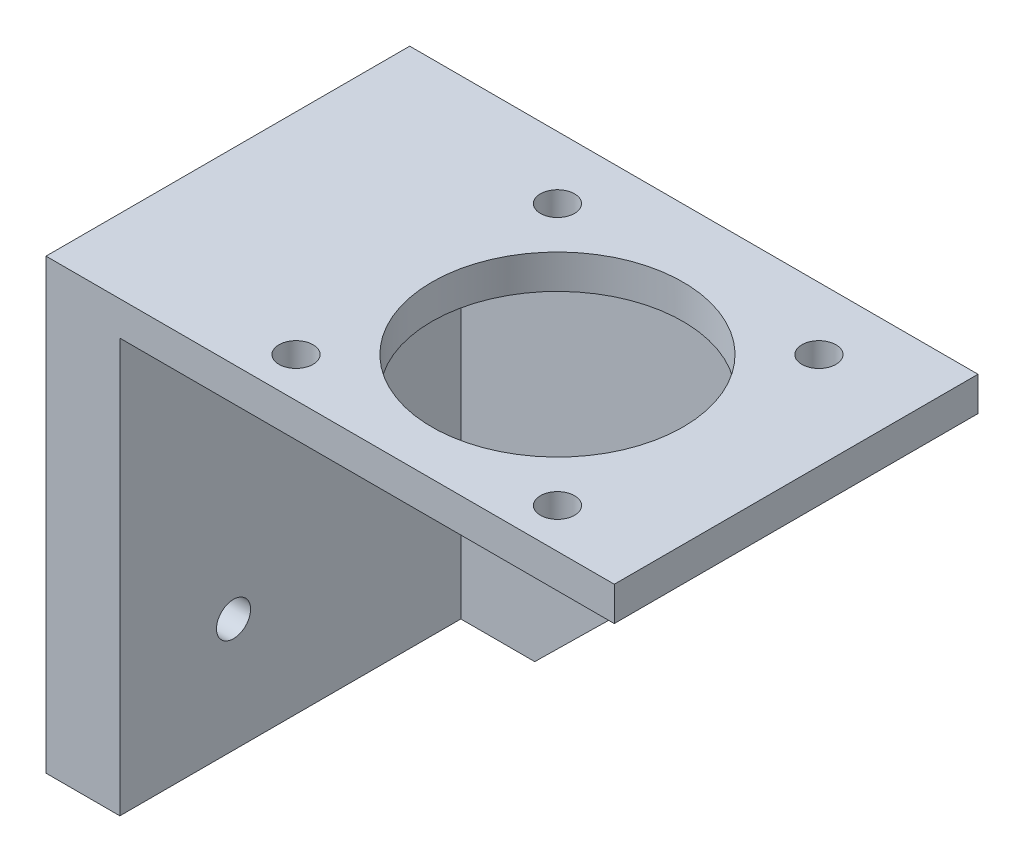
ISO-10303-21;
HEADER;
FILE_DESCRIPTION(('STEP AP214'),'2;1');
FILE_NAME('part.step','',(''),(''),'','','');
FILE_SCHEMA(('AUTOMOTIVE_DESIGN { 1 0 10303 214 1 1 1 1 }'));
ENDSEC;
DATA;
#1=APPLICATION_CONTEXT('core data for automotive mechanical design processes');
#2=APPLICATION_PROTOCOL_DEFINITION('international standard','automotive_design',2000,#1);
#3=PRODUCT_CONTEXT('',#1,'mechanical');
#4=PRODUCT('Part','Part','',(#3));
#5=PRODUCT_RELATED_PRODUCT_CATEGORY('part','',(#4));
#6=PRODUCT_DEFINITION_FORMATION('','',#4);
#7=PRODUCT_DEFINITION_CONTEXT('part definition',#1,'design');
#8=PRODUCT_DEFINITION('design','',#6,#7);
#9=PRODUCT_DEFINITION_SHAPE('','',#8);
#10=(LENGTH_UNIT() NAMED_UNIT(*) SI_UNIT(.MILLI.,.METRE.));
#11=(NAMED_UNIT(*) PLANE_ANGLE_UNIT() SI_UNIT($,.RADIAN.));
#12=(NAMED_UNIT(*) SI_UNIT($,.STERADIAN.) SOLID_ANGLE_UNIT());
#13=UNCERTAINTY_MEASURE_WITH_UNIT(LENGTH_MEASURE(1.E-05),#10,'distance_accuracy_value','');
#14=(GEOMETRIC_REPRESENTATION_CONTEXT(3) GLOBAL_UNCERTAINTY_ASSIGNED_CONTEXT((#13)) GLOBAL_UNIT_ASSIGNED_CONTEXT((#10,
#11,#12)) REPRESENTATION_CONTEXT('',''));
#15=CARTESIAN_POINT('',(0.,0.,0.));
#16=DIRECTION('',(0.,0.,1.));
#17=DIRECTION('',(1.,0.,0.));
#18=AXIS2_PLACEMENT_3D('',#15,#16,#17);
#19=CARTESIAN_POINT('',(0.,16.7,30.));
#20=DIRECTION('',(0.,1.,0.));
#21=DIRECTION('',(0.,0.,1.));
#22=AXIS2_PLACEMENT_3D('',#19,#20,#21);
#23=PLANE('',#22);
#24=CARTESIAN_POINT('',(6.99781651163571,16.7,3.5));
#25=DIRECTION('',(0.,1.,0.));
#26=DIRECTION('',(0.,0.,1.));
#27=AXIS2_PLACEMENT_3D('',#24,#25,#26);
#28=CIRCLE('',#27,1.5);
#29=CARTESIAN_POINT('',(6.99781651163571,16.7,5.));
#30=VERTEX_POINT('',#29);
#31=EDGE_CURVE('E106',#30,#30,#28,.T.);
#32=ORIENTED_EDGE('',*,*,#31,.T.);
#33=EDGE_LOOP('',(#32));
#34=FACE_BOUND('',#33,.T.);
#35=CARTESIAN_POINT('',(30.0021834883643,16.7,3.5));
#36=DIRECTION('',(0.,1.,0.));
#37=DIRECTION('',(0.,0.,1.));
#38=AXIS2_PLACEMENT_3D('',#35,#36,#37);
#39=CIRCLE('',#38,1.5);
#40=CARTESIAN_POINT('',(30.0021834883643,16.7,5.));
#41=VERTEX_POINT('',#40);
#42=EDGE_CURVE('E178',#41,#41,#39,.T.);
#43=ORIENTED_EDGE('',*,*,#42,.T.);
#44=EDGE_LOOP('',(#43));
#45=FACE_BOUND('',#44,.T.);
#46=CARTESIAN_POINT('',(30.0021834883643,16.7,26.5));
#47=DIRECTION('',(0.,1.,0.));
#48=DIRECTION('',(0.,0.,1.));
#49=AXIS2_PLACEMENT_3D('',#46,#47,#48);
#50=CIRCLE('',#49,1.5);
#51=CARTESIAN_POINT('',(30.0021834883643,16.7,28.));
#52=VERTEX_POINT('',#51);
#53=EDGE_CURVE('E175',#52,#52,#50,.T.);
#54=ORIENTED_EDGE('',*,*,#53,.T.);
#55=EDGE_LOOP('',(#54));
#56=FACE_BOUND('',#55,.T.);
#57=CARTESIAN_POINT('',(6.99781651163571,16.7,26.5));
#58=DIRECTION('',(0.,1.,0.));
#59=DIRECTION('',(0.,0.,1.));
#60=AXIS2_PLACEMENT_3D('',#57,#58,#59);
#61=CIRCLE('',#60,1.5);
#62=CARTESIAN_POINT('',(6.99781651163571,16.7,28.));
#63=VERTEX_POINT('',#62);
#64=EDGE_CURVE('E172',#63,#63,#61,.T.);
#65=ORIENTED_EDGE('',*,*,#64,.T.);
#66=EDGE_LOOP('',(#65));
#67=FACE_BOUND('',#66,.T.);
#68=CARTESIAN_POINT('',(18.5,16.7,15.));
#69=DIRECTION('',(0.,1.,0.));
#70=DIRECTION('',(0.,0.,1.));
#71=AXIS2_PLACEMENT_3D('',#68,#69,#70);
#72=CIRCLE('',#71,11.05);
#73=CARTESIAN_POINT('',(18.5,16.7,26.05));
#74=VERTEX_POINT('',#73);
#75=EDGE_CURVE('E169',#74,#74,#72,.T.);
#76=ORIENTED_EDGE('',*,*,#75,.T.);
#77=EDGE_LOOP('',(#76));
#78=FACE_BOUND('',#77,.T.);
#79=DIRECTION('',(1.,0.,0.));
#80=VECTOR('',#79,1.);
#81=CARTESIAN_POINT('',(0.,16.7,0.));
#82=LINE('',#81,#80);
#83=CARTESIAN_POINT('',(-5.,16.7,0.));
#84=VERTEX_POINT('',#83);
#85=CARTESIAN_POINT('',(38.5,16.7,0.));
#86=VERTEX_POINT('',#85);
#87=EDGE_CURVE('E94',#84,#86,#82,.T.);
#88=ORIENTED_EDGE('',*,*,#87,.T.);
#89=DIRECTION('',(0.,0.,-1.));
#90=VECTOR('',#89,1.);
#91=CARTESIAN_POINT('',(38.5,16.7,30.));
#92=LINE('',#91,#90);
#93=CARTESIAN_POINT('',(38.5,16.7,30.));
#94=VERTEX_POINT('',#93);
#95=EDGE_CURVE('E11',#94,#86,#92,.T.);
#96=ORIENTED_EDGE('',*,*,#95,.F.);
#97=DIRECTION('',(1.,0.,0.));
#98=VECTOR('',#97,1.);
#99=CARTESIAN_POINT('',(0.,16.7,30.));
#100=LINE('',#99,#98);
#101=CARTESIAN_POINT('',(-5.,16.7,30.));
#102=VERTEX_POINT('',#101);
#103=EDGE_CURVE('E105',#102,#94,#100,.T.);
#104=ORIENTED_EDGE('',*,*,#103,.F.);
#105=DIRECTION('',(0.,0.,1.));
#106=VECTOR('',#105,1.);
#107=CARTESIAN_POINT('',(-5.,16.7,0.));
#108=LINE('',#107,#106);
#109=EDGE_CURVE('E109',#84,#102,#108,.T.);
#110=ORIENTED_EDGE('',*,*,#109,.F.);
#111=EDGE_LOOP('',(#88,#96,#104,#110));
#112=FACE_BOUND('',#111,.T.);
#113=ADVANCED_FACE('F35',(#34,#45,#56,#67,#78,#112),#23,.F.);
#114=CARTESIAN_POINT('',(38.5,0.,30.));
#115=DIRECTION('',(1.,0.,0.));
#116=DIRECTION('',(0.,0.,-1.));
#117=AXIS2_PLACEMENT_3D('',#114,#115,#116);
#118=PLANE('',#117);
#119=ORIENTED_EDGE('',*,*,#95,.T.);
#120=DIRECTION('',(0.,0.,1.));
#121=VECTOR('',#120,1.);
#122=CARTESIAN_POINT('',(38.5,16.7,-2.));
#123=LINE('',#122,#121);
#124=CARTESIAN_POINT('',(38.5,16.7,-2.));
#125=VERTEX_POINT('',#124);
#126=EDGE_CURVE('E150',#125,#86,#123,.T.);
#127=ORIENTED_EDGE('',*,*,#126,.F.);
#128=DIRECTION('',(0.,1.,0.));
#129=VECTOR('',#128,1.);
#130=CARTESIAN_POINT('',(38.5,19.7,-2.));
#131=LINE('',#130,#129);
#132=CARTESIAN_POINT('',(38.5,19.7,-2.));
#133=VERTEX_POINT('',#132);
#134=EDGE_CURVE('E144',#125,#133,#131,.T.);
#135=ORIENTED_EDGE('',*,*,#134,.T.);
#136=DIRECTION('',(0.,0.,-1.));
#137=VECTOR('',#136,1.);
#138=CARTESIAN_POINT('',(38.5,19.7,30.));
#139=LINE('',#138,#137);
#140=CARTESIAN_POINT('',(38.5,19.7,30.));
#141=VERTEX_POINT('',#140);
#142=EDGE_CURVE('E44',#141,#133,#139,.T.);
#143=ORIENTED_EDGE('',*,*,#142,.F.);
#144=DIRECTION('',(0.,-1.,0.));
#145=VECTOR('',#144,1.);
#146=CARTESIAN_POINT('',(38.5,0.,30.));
#147=LINE('',#146,#145);
#148=EDGE_CURVE('E184',#141,#94,#147,.T.);
#149=ORIENTED_EDGE('',*,*,#148,.T.);
#150=EDGE_LOOP('',(#119,#127,#135,#143,#149));
#151=FACE_BOUND('',#150,.T.);
#152=ADVANCED_FACE('F217',(#151),#118,.T.);
#153=CARTESIAN_POINT('',(0.,19.7,30.));
#154=DIRECTION('',(0.,1.,0.));
#155=DIRECTION('',(-1.,0.,0.));
#156=AXIS2_PLACEMENT_3D('',#153,#154,#155);
#157=PLANE('',#156);
#158=CARTESIAN_POINT('',(6.99781651163571,19.7,3.5));
#159=DIRECTION('',(0.,1.,0.));
#160=DIRECTION('',(1.,0.,0.));
#161=AXIS2_PLACEMENT_3D('',#158,#159,#160);
#162=CIRCLE('',#161,1.5);
#163=CARTESIAN_POINT('',(8.49781651163571,19.7,3.5));
#164=VERTEX_POINT('',#163);
#165=EDGE_CURVE('E152',#164,#164,#162,.T.);
#166=ORIENTED_EDGE('',*,*,#165,.F.);
#167=EDGE_LOOP('',(#166));
#168=FACE_BOUND('',#167,.T.);
#169=CARTESIAN_POINT('',(30.0021834883643,19.6999999999999,3.5));
#170=DIRECTION('',(0.,1.,0.));
#171=DIRECTION('',(1.,0.,0.));
#172=AXIS2_PLACEMENT_3D('',#169,#170,#171);
#173=CIRCLE('',#172,1.5);
#174=CARTESIAN_POINT('',(31.5021834883643,19.6999999999999,3.5));
#175=VERTEX_POINT('',#174);
#176=EDGE_CURVE('E162',#175,#175,#173,.T.);
#177=ORIENTED_EDGE('',*,*,#176,.F.);
#178=EDGE_LOOP('',(#177));
#179=FACE_BOUND('',#178,.T.);
#180=CARTESIAN_POINT('',(30.0021834883643,19.6999999999999,26.5));
#181=DIRECTION('',(0.,1.,0.));
#182=DIRECTION('',(-1.,0.,0.));
#183=AXIS2_PLACEMENT_3D('',#180,#181,#182);
#184=CIRCLE('',#183,1.5);
#185=CARTESIAN_POINT('',(28.5021834883643,19.6999999999999,26.5));
#186=VERTEX_POINT('',#185);
#187=EDGE_CURVE('E159',#186,#186,#184,.T.);
#188=ORIENTED_EDGE('',*,*,#187,.F.);
#189=EDGE_LOOP('',(#188));
#190=FACE_BOUND('',#189,.T.);
#191=CARTESIAN_POINT('',(6.99781651163571,19.7,26.5));
#192=DIRECTION('',(0.,1.,0.));
#193=DIRECTION('',(-1.,0.,0.));
#194=AXIS2_PLACEMENT_3D('',#191,#192,#193);
#195=CIRCLE('',#194,1.5);
#196=CARTESIAN_POINT('',(5.49781651163571,19.7,26.5));
#197=VERTEX_POINT('',#196);
#198=EDGE_CURVE('E155',#197,#197,#195,.T.);
#199=ORIENTED_EDGE('',*,*,#198,.F.);
#200=EDGE_LOOP('',(#199));
#201=FACE_BOUND('',#200,.T.);
#202=CARTESIAN_POINT('',(18.5,19.7,15.));
#203=DIRECTION('',(0.,1.,0.));
#204=DIRECTION('',(-1.,0.,0.));
#205=AXIS2_PLACEMENT_3D('',#202,#203,#204);
#206=CIRCLE('',#205,11.05);
#207=CARTESIAN_POINT('',(7.45,19.7,15.));
#208=VERTEX_POINT('',#207);
#209=EDGE_CURVE('E158',#208,#208,#206,.T.);
#210=ORIENTED_EDGE('',*,*,#209,.F.);
#211=EDGE_LOOP('',(#210));
#212=FACE_BOUND('',#211,.T.);
#213=ORIENTED_EDGE('',*,*,#142,.T.);
#214=DIRECTION('',(-1.,0.,0.));
#215=VECTOR('',#214,1.);
#216=CARTESIAN_POINT('',(-1.5,19.7,-2.));
#217=LINE('',#216,#215);
#218=CARTESIAN_POINT('',(-11.5,19.7,-2.));
#219=VERTEX_POINT('',#218);
#220=EDGE_CURVE('E146',#133,#219,#217,.T.);
#221=ORIENTED_EDGE('',*,*,#220,.T.);
#222=DIRECTION('',(0.,0.,-1.));
#223=VECTOR('',#222,1.);
#224=CARTESIAN_POINT('',(-11.5,19.7,-2.));
#225=LINE('',#224,#223);
#226=CARTESIAN_POINT('',(-11.5,19.7,30.));
#227=VERTEX_POINT('',#226);
#228=EDGE_CURVE('E135',#227,#219,#225,.T.);
#229=ORIENTED_EDGE('',*,*,#228,.F.);
#230=DIRECTION('',(1.,0.,0.));
#231=VECTOR('',#230,1.);
#232=CARTESIAN_POINT('',(0.,19.7,30.));
#233=LINE('',#232,#231);
#234=EDGE_CURVE('E186',#227,#141,#233,.T.);
#235=ORIENTED_EDGE('',*,*,#234,.T.);
#236=EDGE_LOOP('',(#213,#221,#229,#235));
#237=FACE_BOUND('',#236,.T.);
#238=ADVANCED_FACE('F222',(#168,#179,#190,#201,#212,#237),#157,.T.);
#239=CARTESIAN_POINT('',(0.,-19.7,30.));
#240=DIRECTION('',(0.,1.,0.));
#241=DIRECTION('',(0.,0.,1.));
#242=AXIS2_PLACEMENT_3D('',#239,#240,#241);
#243=PLANE('',#242);
#244=DIRECTION('',(1.,0.,0.));
#245=VECTOR('',#244,1.);
#246=CARTESIAN_POINT('',(1.5,-19.7,0.));
#247=LINE('',#246,#245);
#248=CARTESIAN_POINT('',(-5.,-19.7,0.));
#249=VERTEX_POINT('',#248);
#250=CARTESIAN_POINT('',(1.5,-19.7,0.));
#251=VERTEX_POINT('',#250);
#252=EDGE_CURVE('E113',#249,#251,#247,.T.);
#253=ORIENTED_EDGE('',*,*,#252,.F.);
#254=DIRECTION('',(0.,0.,1.));
#255=VECTOR('',#254,1.);
#256=CARTESIAN_POINT('',(-5.,-19.7,0.));
#257=LINE('',#256,#255);
#258=CARTESIAN_POINT('',(-5.,-19.7,30.));
#259=VERTEX_POINT('',#258);
#260=EDGE_CURVE('E112',#249,#259,#257,.T.);
#261=ORIENTED_EDGE('',*,*,#260,.T.);
#262=DIRECTION('',(1.,0.,0.));
#263=VECTOR('',#262,1.);
#264=CARTESIAN_POINT('',(0.,-19.7,30.));
#265=LINE('',#264,#263);
#266=CARTESIAN_POINT('',(-11.5,-19.7,30.));
#267=VERTEX_POINT('',#266);
#268=EDGE_CURVE('E189',#267,#259,#265,.T.);
#269=ORIENTED_EDGE('',*,*,#268,.F.);
#270=DIRECTION('',(0.,0.,1.));
#271=VECTOR('',#270,1.);
#272=CARTESIAN_POINT('',(-11.5,-19.7,30.));
#273=LINE('',#272,#271);
#274=CARTESIAN_POINT('',(-11.5,-19.7,-2.));
#275=VERTEX_POINT('',#274);
#276=EDGE_CURVE('E129',#275,#267,#273,.T.);
#277=ORIENTED_EDGE('',*,*,#276,.F.);
#278=DIRECTION('',(1.,0.,0.));
#279=VECTOR('',#278,1.);
#280=CARTESIAN_POINT('',(1.5,-19.7,-2.));
#281=LINE('',#280,#279);
#282=CARTESIAN_POINT('',(1.5,-19.7,-2.));
#283=VERTEX_POINT('',#282);
#284=EDGE_CURVE('E138',#275,#283,#281,.T.);
#285=ORIENTED_EDGE('',*,*,#284,.T.);
#286=DIRECTION('',(0.,0.,1.));
#287=VECTOR('',#286,1.);
#288=CARTESIAN_POINT('',(1.5,-19.7,-2.));
#289=LINE('',#288,#287);
#290=EDGE_CURVE('E148',#283,#251,#289,.T.);
#291=ORIENTED_EDGE('',*,*,#290,.T.);
#292=EDGE_LOOP('',(#253,#261,#269,#277,#285,#291));
#293=FACE_BOUND('',#292,.T.);
#294=ADVANCED_FACE('F246',(#293),#243,.F.);
#295=CARTESIAN_POINT('',(0.,0.,30.));
#296=DIRECTION('',(0.,0.,1.));
#297=DIRECTION('',(1.,0.,0.));
#298=AXIS2_PLACEMENT_3D('',#295,#296,#297);
#299=PLANE('',#298);
#300=DIRECTION('',(0.,-1.,0.));
#301=VECTOR('',#300,1.);
#302=CARTESIAN_POINT('',(-5.,-19.7,30.));
#303=LINE('',#302,#301);
#304=EDGE_CURVE('E117',#102,#259,#303,.T.);
#305=ORIENTED_EDGE('',*,*,#304,.F.);
#306=ORIENTED_EDGE('',*,*,#103,.T.);
#307=ORIENTED_EDGE('',*,*,#148,.F.);
#308=ORIENTED_EDGE('',*,*,#234,.F.);
#309=DIRECTION('',(0.,1.,0.));
#310=VECTOR('',#309,1.);
#311=CARTESIAN_POINT('',(-11.5,19.7,30.));
#312=LINE('',#311,#310);
#313=EDGE_CURVE('E132',#267,#227,#312,.T.);
#314=ORIENTED_EDGE('',*,*,#313,.F.);
#315=ORIENTED_EDGE('',*,*,#268,.T.);
#316=EDGE_LOOP('',(#305,#306,#307,#308,#314,#315));
#317=FACE_BOUND('',#316,.T.);
#318=ADVANCED_FACE('F236',(#317),#299,.T.);
#319=CARTESIAN_POINT('',(18.5,-10.3,15.));
#320=DIRECTION('',(0.,1.,0.));
#321=DIRECTION('',(-1.,0.,0.));
#322=AXIS2_PLACEMENT_3D('',#319,#320,#321);
#323=CYLINDRICAL_SURFACE('',#322,11.05);
#324=ORIENTED_EDGE('',*,*,#209,.T.);
#325=EDGE_LOOP('',(#324));
#326=FACE_BOUND('',#325,.T.);
#327=ORIENTED_EDGE('',*,*,#75,.F.);
#328=EDGE_LOOP('',(#327));
#329=FACE_BOUND('',#328,.T.);
#330=ADVANCED_FACE('F233',(#326,#329),#323,.F.);
#331=CARTESIAN_POINT('',(6.99781651163568,-10.3,26.5));
#332=DIRECTION('',(0.,1.,0.));
#333=DIRECTION('',(-1.,0.,0.));
#334=AXIS2_PLACEMENT_3D('',#331,#332,#333);
#335=CYLINDRICAL_SURFACE('',#334,1.5);
#336=ORIENTED_EDGE('',*,*,#198,.T.);
#337=EDGE_LOOP('',(#336));
#338=FACE_BOUND('',#337,.T.);
#339=ORIENTED_EDGE('',*,*,#64,.F.);
#340=EDGE_LOOP('',(#339));
#341=FACE_BOUND('',#340,.T.);
#342=ADVANCED_FACE('F235',(#338,#341),#335,.F.);
#343=CARTESIAN_POINT('',(30.0021834883643,-10.3000000000001,26.5));
#344=DIRECTION('',(0.,1.,0.));
#345=DIRECTION('',(-1.,0.,0.));
#346=AXIS2_PLACEMENT_3D('',#343,#344,#345);
#347=CYLINDRICAL_SURFACE('',#346,1.5);
#348=ORIENTED_EDGE('',*,*,#187,.T.);
#349=EDGE_LOOP('',(#348));
#350=FACE_BOUND('',#349,.T.);
#351=ORIENTED_EDGE('',*,*,#53,.F.);
#352=EDGE_LOOP('',(#351));
#353=FACE_BOUND('',#352,.T.);
#354=ADVANCED_FACE('F243',(#350,#353),#347,.F.);
#355=CARTESIAN_POINT('',(30.0021834883643,-10.3000000000001,3.5));
#356=DIRECTION('',(0.,1.,0.));
#357=DIRECTION('',(-1.,0.,0.));
#358=AXIS2_PLACEMENT_3D('',#355,#356,#357);
#359=CYLINDRICAL_SURFACE('',#358,1.5);
#360=ORIENTED_EDGE('',*,*,#176,.T.);
#361=EDGE_LOOP('',(#360));
#362=FACE_BOUND('',#361,.T.);
#363=ORIENTED_EDGE('',*,*,#42,.F.);
#364=EDGE_LOOP('',(#363));
#365=FACE_BOUND('',#364,.T.);
#366=ADVANCED_FACE('F293',(#362,#365),#359,.F.);
#367=CARTESIAN_POINT('',(6.99781651163568,-10.3,3.5));
#368=DIRECTION('',(0.,1.,0.));
#369=DIRECTION('',(-1.,0.,0.));
#370=AXIS2_PLACEMENT_3D('',#367,#368,#369);
#371=CYLINDRICAL_SURFACE('',#370,1.5);
#372=ORIENTED_EDGE('',*,*,#165,.T.);
#373=EDGE_LOOP('',(#372));
#374=FACE_BOUND('',#373,.T.);
#375=ORIENTED_EDGE('',*,*,#31,.F.);
#376=EDGE_LOOP('',(#375));
#377=FACE_BOUND('',#376,.T.);
#378=ADVANCED_FACE('F250',(#374,#377),#371,.F.);
#379=CARTESIAN_POINT('',(0.,0.,0.));
#380=DIRECTION('',(0.,0.,-1.));
#381=DIRECTION('',(-1.,0.,0.));
#382=AXIS2_PLACEMENT_3D('',#379,#380,#381);
#383=PLANE('',#382);
#384=ORIENTED_EDGE('',*,*,#87,.F.);
#385=DIRECTION('',(0.,-1.,0.));
#386=VECTOR('',#385,1.);
#387=CARTESIAN_POINT('',(-5.,-19.7,0.));
#388=LINE('',#387,#386);
#389=EDGE_CURVE('E98',#84,#249,#388,.T.);
#390=ORIENTED_EDGE('',*,*,#389,.T.);
#391=ORIENTED_EDGE('',*,*,#252,.T.);
#392=DIRECTION('',(0.712863129036722,0.701303186403694,0.));
#393=VECTOR('',#392,1.);
#394=CARTESIAN_POINT('',(38.5,16.7,0.));
#395=LINE('',#394,#393);
#396=EDGE_CURVE('E101',#251,#86,#395,.T.);
#397=ORIENTED_EDGE('',*,*,#396,.T.);
#398=EDGE_LOOP('',(#384,#390,#391,#397));
#399=FACE_BOUND('',#398,.T.);
#400=ADVANCED_FACE('F96',(#399),#383,.F.);
#401=CARTESIAN_POINT('',(38.5,16.7,-2.));
#402=DIRECTION('',(0.701303186403694,-0.712863129036722,0.));
#403=DIRECTION('',(0.712863129036722,0.701303186403694,0.));
#404=AXIS2_PLACEMENT_3D('',#401,#402,#403);
#405=PLANE('',#404);
#406=ORIENTED_EDGE('',*,*,#396,.F.);
#407=ORIENTED_EDGE('',*,*,#290,.F.);
#408=DIRECTION('',(0.712863129036722,0.701303186403694,0.));
#409=VECTOR('',#408,1.);
#410=CARTESIAN_POINT('',(38.5,16.7,-2.));
#411=LINE('',#410,#409);
#412=EDGE_CURVE('E141',#283,#125,#411,.T.);
#413=ORIENTED_EDGE('',*,*,#412,.T.);
#414=ORIENTED_EDGE('',*,*,#126,.T.);
#415=EDGE_LOOP('',(#406,#407,#413,#414));
#416=FACE_BOUND('',#415,.T.);
#417=ADVANCED_FACE('F282',(#416),#405,.T.);
#418=CARTESIAN_POINT('',(0.,0.,-2.));
#419=DIRECTION('',(0.,0.,-1.));
#420=DIRECTION('',(-1.,0.,0.));
#421=AXIS2_PLACEMENT_3D('',#418,#419,#420);
#422=PLANE('',#421);
#423=ORIENTED_EDGE('',*,*,#284,.F.);
#424=DIRECTION('',(0.,-1.,0.));
#425=VECTOR('',#424,1.);
#426=CARTESIAN_POINT('',(-11.5,-19.7,-2.));
#427=LINE('',#426,#425);
#428=EDGE_CURVE('E125',#219,#275,#427,.T.);
#429=ORIENTED_EDGE('',*,*,#428,.F.);
#430=ORIENTED_EDGE('',*,*,#220,.F.);
#431=ORIENTED_EDGE('',*,*,#134,.F.);
#432=ORIENTED_EDGE('',*,*,#412,.F.);
#433=EDGE_LOOP('',(#423,#429,#430,#431,#432));
#434=FACE_BOUND('',#433,.T.);
#435=ADVANCED_FACE('F276',(#434),#422,.T.);
#436=CARTESIAN_POINT('',(-11.5,0.,0.));
#437=DIRECTION('',(1.,0.,0.));
#438=DIRECTION('',(0.,1.,0.));
#439=AXIS2_PLACEMENT_3D('',#436,#437,#438);
#440=PLANE('',#439);
#441=CARTESIAN_POINT('',(-11.5,14.7,5.));
#442=DIRECTION('',(-1.,0.,0.));
#443=DIRECTION('',(0.,-1.,0.));
#444=AXIS2_PLACEMENT_3D('',#441,#442,#443);
#445=CIRCLE('',#444,1.5);
#446=CARTESIAN_POINT('',(-11.5,13.2,5.));
#447=VERTEX_POINT('',#446);
#448=EDGE_CURVE('E196',#447,#447,#445,.T.);
#449=ORIENTED_EDGE('',*,*,#448,.F.);
#450=EDGE_LOOP('',(#449));
#451=FACE_BOUND('',#450,.T.);
#452=CARTESIAN_POINT('',(-11.5,14.7,20.));
#453=DIRECTION('',(-1.,0.,0.));
#454=DIRECTION('',(0.,-1.,0.));
#455=AXIS2_PLACEMENT_3D('',#452,#453,#454);
#456=CIRCLE('',#455,1.5);
#457=CARTESIAN_POINT('',(-11.5,13.2,20.));
#458=VERTEX_POINT('',#457);
#459=EDGE_CURVE('E368',#458,#458,#456,.T.);
#460=ORIENTED_EDGE('',*,*,#459,.F.);
#461=EDGE_LOOP('',(#460));
#462=FACE_BOUND('',#461,.T.);
#463=CARTESIAN_POINT('',(-11.5,-9.70000000000002,20.));
#464=DIRECTION('',(-1.,0.,0.));
#465=DIRECTION('',(0.,-1.,0.));
#466=AXIS2_PLACEMENT_3D('',#463,#464,#465);
#467=CIRCLE('',#466,1.5);
#468=CARTESIAN_POINT('',(-11.5,-11.2,20.));
#469=VERTEX_POINT('',#468);
#470=EDGE_CURVE('E122',#469,#469,#467,.T.);
#471=ORIENTED_EDGE('',*,*,#470,.F.);
#472=EDGE_LOOP('',(#471));
#473=FACE_BOUND('',#472,.T.);
#474=ORIENTED_EDGE('',*,*,#428,.T.);
#475=ORIENTED_EDGE('',*,*,#276,.T.);
#476=ORIENTED_EDGE('',*,*,#313,.T.);
#477=ORIENTED_EDGE('',*,*,#228,.T.);
#478=EDGE_LOOP('',(#474,#475,#476,#477));
#479=FACE_BOUND('',#478,.T.);
#480=ADVANCED_FACE('F279',(#451,#462,#473,#479),#440,.F.);
#481=CARTESIAN_POINT('',(-5.,-19.7,0.));
#482=DIRECTION('',(-1.,0.,0.));
#483=DIRECTION('',(0.,0.,1.));
#484=AXIS2_PLACEMENT_3D('',#481,#482,#483);
#485=PLANE('',#484);
#486=CARTESIAN_POINT('',(-5.,14.7,5.));
#487=DIRECTION('',(-1.,0.,0.));
#488=DIRECTION('',(0.,0.,1.));
#489=AXIS2_PLACEMENT_3D('',#486,#487,#488);
#490=CIRCLE('',#489,1.5);
#491=CARTESIAN_POINT('',(-5.,14.7,6.5));
#492=VERTEX_POINT('',#491);
#493=EDGE_CURVE('E38',#492,#492,#490,.T.);
#494=ORIENTED_EDGE('',*,*,#493,.T.);
#495=EDGE_LOOP('',(#494));
#496=FACE_BOUND('',#495,.T.);
#497=CARTESIAN_POINT('',(-5.,14.7,20.));
#498=DIRECTION('',(-1.,0.,0.));
#499=DIRECTION('',(0.,0.,1.));
#500=AXIS2_PLACEMENT_3D('',#497,#498,#499);
#501=CIRCLE('',#500,1.5);
#502=CARTESIAN_POINT('',(-5.,14.7,21.5));
#503=VERTEX_POINT('',#502);
#504=EDGE_CURVE('E195',#503,#503,#501,.T.);
#505=ORIENTED_EDGE('',*,*,#504,.T.);
#506=EDGE_LOOP('',(#505));
#507=FACE_BOUND('',#506,.T.);
#508=CARTESIAN_POINT('',(-5.,-9.70000000000001,20.));
#509=DIRECTION('',(-1.,0.,0.));
#510=DIRECTION('',(0.,0.,1.));
#511=AXIS2_PLACEMENT_3D('',#508,#509,#510);
#512=CIRCLE('',#511,1.5);
#513=CARTESIAN_POINT('',(-5.,-9.70000000000001,21.5));
#514=VERTEX_POINT('',#513);
#515=EDGE_CURVE('E193',#514,#514,#512,.T.);
#516=ORIENTED_EDGE('',*,*,#515,.T.);
#517=EDGE_LOOP('',(#516));
#518=FACE_BOUND('',#517,.T.);
#519=ORIENTED_EDGE('',*,*,#304,.T.);
#520=ORIENTED_EDGE('',*,*,#260,.F.);
#521=ORIENTED_EDGE('',*,*,#389,.F.);
#522=ORIENTED_EDGE('',*,*,#109,.T.);
#523=EDGE_LOOP('',(#519,#520,#521,#522));
#524=FACE_BOUND('',#523,.T.);
#525=ADVANCED_FACE('F115',(#496,#507,#518,#524),#485,.F.);
#526=CARTESIAN_POINT('',(-1.5,-9.70000000000001,20.));
#527=DIRECTION('',(-1.,0.,0.));
#528=DIRECTION('',(0.,-1.,0.));
#529=AXIS2_PLACEMENT_3D('',#526,#527,#528);
#530=CYLINDRICAL_SURFACE('',#529,1.5);
#531=ORIENTED_EDGE('',*,*,#470,.T.);
#532=EDGE_LOOP('',(#531));
#533=FACE_BOUND('',#532,.T.);
#534=ORIENTED_EDGE('',*,*,#515,.F.);
#535=EDGE_LOOP('',(#534));
#536=FACE_BOUND('',#535,.T.);
#537=ADVANCED_FACE('F212',(#533,#536),#530,.F.);
#538=CARTESIAN_POINT('',(-1.5,14.7,20.));
#539=DIRECTION('',(-1.,0.,0.));
#540=DIRECTION('',(0.,-1.,0.));
#541=AXIS2_PLACEMENT_3D('',#538,#539,#540);
#542=CYLINDRICAL_SURFACE('',#541,1.5);
#543=ORIENTED_EDGE('',*,*,#459,.T.);
#544=EDGE_LOOP('',(#543));
#545=FACE_BOUND('',#544,.T.);
#546=ORIENTED_EDGE('',*,*,#504,.F.);
#547=EDGE_LOOP('',(#546));
#548=FACE_BOUND('',#547,.T.);
#549=ADVANCED_FACE('F206',(#545,#548),#542,.F.);
#550=CARTESIAN_POINT('',(-1.5,14.7,5.));
#551=DIRECTION('',(-1.,0.,0.));
#552=DIRECTION('',(0.,-1.,0.));
#553=AXIS2_PLACEMENT_3D('',#550,#551,#552);
#554=CYLINDRICAL_SURFACE('',#553,1.5);
#555=ORIENTED_EDGE('',*,*,#448,.T.);
#556=EDGE_LOOP('',(#555));
#557=FACE_BOUND('',#556,.T.);
#558=ORIENTED_EDGE('',*,*,#493,.F.);
#559=EDGE_LOOP('',(#558));
#560=FACE_BOUND('',#559,.T.);
#561=ADVANCED_FACE('F204',(#557,#560),#554,.F.);
#562=CLOSED_SHELL('',(#113,#152,#238,#294,#318,#330,#342,#354,#366,#378,#400,#417,#435,#480,
#525,#537,#549,#561));
#563=MANIFOLD_SOLID_BREP('B2',#562);
#564=ADVANCED_BREP_SHAPE_REPRESENTATION('',(#18,#563),#14);
#565=SHAPE_DEFINITION_REPRESENTATION(#9,#564);
ENDSEC;
END-ISO-10303-21;
